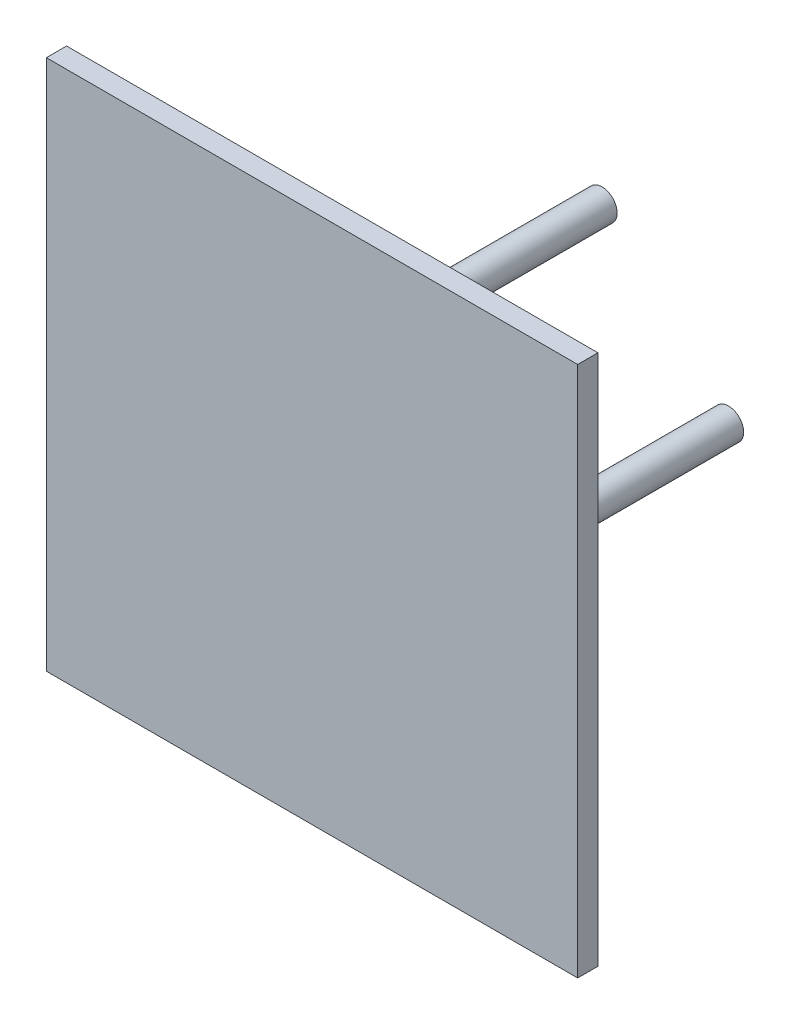
ISO-10303-21;
HEADER;
FILE_DESCRIPTION(('STEP AP214'),'2;1');
FILE_NAME('part.step','',(''),(''),'','','');
FILE_SCHEMA(('AUTOMOTIVE_DESIGN { 1 0 10303 214 1 1 1 1 }'));
ENDSEC;
DATA;
#1=APPLICATION_CONTEXT('core data for automotive mechanical design processes');
#2=APPLICATION_PROTOCOL_DEFINITION('international standard','automotive_design',2000,#1);
#3=PRODUCT_CONTEXT('',#1,'mechanical');
#4=PRODUCT('Part','Part','',(#3));
#5=PRODUCT_RELATED_PRODUCT_CATEGORY('part','',(#4));
#6=PRODUCT_DEFINITION_FORMATION('','',#4);
#7=PRODUCT_DEFINITION_CONTEXT('part definition',#1,'design');
#8=PRODUCT_DEFINITION('design','',#6,#7);
#9=PRODUCT_DEFINITION_SHAPE('','',#8);
#10=(LENGTH_UNIT() NAMED_UNIT(*) SI_UNIT(.MILLI.,.METRE.));
#11=(NAMED_UNIT(*) PLANE_ANGLE_UNIT() SI_UNIT($,.RADIAN.));
#12=(NAMED_UNIT(*) SI_UNIT($,.STERADIAN.) SOLID_ANGLE_UNIT());
#13=UNCERTAINTY_MEASURE_WITH_UNIT(LENGTH_MEASURE(1.E-05),#10,'distance_accuracy_value','');
#14=(GEOMETRIC_REPRESENTATION_CONTEXT(3) GLOBAL_UNCERTAINTY_ASSIGNED_CONTEXT((#13)) GLOBAL_UNIT_ASSIGNED_CONTEXT((#10,
#11,#12)) REPRESENTATION_CONTEXT('',''));
#15=CARTESIAN_POINT('',(0.,0.,0.));
#16=DIRECTION('',(0.,0.,1.));
#17=DIRECTION('',(1.,0.,0.));
#18=AXIS2_PLACEMENT_3D('',#15,#16,#17);
#19=CARTESIAN_POINT('',(0.,0.,0.));
#20=DIRECTION('',(0.,0.,-1.));
#21=DIRECTION('',(-1.,0.,0.));
#22=AXIS2_PLACEMENT_3D('',#19,#20,#21);
#23=PLANE('',#22);
#24=CARTESIAN_POINT('',(77.5,52.5,0.));
#25=DIRECTION('',(0.,0.,-1.));
#26=DIRECTION('',(-1.,0.,0.));
#27=AXIS2_PLACEMENT_3D('',#24,#25,#26);
#28=CIRCLE('',#27,3.00000000000001);
#29=CARTESIAN_POINT('',(74.5,52.5,0.));
#30=VERTEX_POINT('',#29);
#31=EDGE_CURVE('E307',#30,#30,#28,.T.);
#32=ORIENTED_EDGE('',*,*,#31,.F.);
#33=EDGE_LOOP('',(#32));
#34=FACE_BOUND('',#33,.T.);
#35=CARTESIAN_POINT('',(52.5,27.5,0.));
#36=DIRECTION('',(0.,0.,-1.));
#37=DIRECTION('',(-1.,0.,0.));
#38=AXIS2_PLACEMENT_3D('',#35,#36,#37);
#39=CIRCLE('',#38,3.);
#40=CARTESIAN_POINT('',(49.5,27.5,0.));
#41=VERTEX_POINT('',#40);
#42=EDGE_CURVE('E301',#41,#41,#39,.T.);
#43=ORIENTED_EDGE('',*,*,#42,.F.);
#44=EDGE_LOOP('',(#43));
#45=FACE_BOUND('',#44,.T.);
#46=CARTESIAN_POINT('',(27.5,52.5,0.));
#47=DIRECTION('',(0.,0.,-1.));
#48=DIRECTION('',(-1.,0.,0.));
#49=AXIS2_PLACEMENT_3D('',#46,#47,#48);
#50=CIRCLE('',#49,2.99999999999999);
#51=CARTESIAN_POINT('',(24.5,52.5,0.));
#52=VERTEX_POINT('',#51);
#53=EDGE_CURVE('E295',#52,#52,#50,.T.);
#54=ORIENTED_EDGE('',*,*,#53,.F.);
#55=EDGE_LOOP('',(#54));
#56=FACE_BOUND('',#55,.T.);
#57=CARTESIAN_POINT('',(52.5,77.5,0.));
#58=DIRECTION('',(0.,0.,-1.));
#59=DIRECTION('',(-1.,0.,0.));
#60=AXIS2_PLACEMENT_3D('',#57,#58,#59);
#61=CIRCLE('',#60,3.);
#62=CARTESIAN_POINT('',(49.5,77.5,0.));
#63=VERTEX_POINT('',#62);
#64=EDGE_CURVE('E289',#63,#63,#61,.T.);
#65=ORIENTED_EDGE('',*,*,#64,.F.);
#66=EDGE_LOOP('',(#65));
#67=FACE_BOUND('',#66,.T.);
#68=CARTESIAN_POINT('',(52.5,52.5,0.));
#69=DIRECTION('',(0.,0.,-1.));
#70=DIRECTION('',(-1.,0.,0.));
#71=AXIS2_PLACEMENT_3D('',#68,#69,#70);
#72=CIRCLE('',#71,3.);
#73=CARTESIAN_POINT('',(49.5,52.5,0.));
#74=VERTEX_POINT('',#73);
#75=EDGE_CURVE('E162',#74,#74,#72,.T.);
#76=ORIENTED_EDGE('',*,*,#75,.F.);
#77=EDGE_LOOP('',(#76));
#78=FACE_BOUND('',#77,.T.);
#79=DIRECTION('',(0.,-1.,0.));
#80=VECTOR('',#79,1.);
#81=CARTESIAN_POINT('',(0.,0.,0.));
#82=LINE('',#81,#80);
#83=CARTESIAN_POINT('',(0.,105.,0.));
#84=VERTEX_POINT('',#83);
#85=CARTESIAN_POINT('',(0.,0.,0.));
#86=VERTEX_POINT('',#85);
#87=EDGE_CURVE('E173',#84,#86,#82,.T.);
#88=ORIENTED_EDGE('',*,*,#87,.F.);
#89=DIRECTION('',(-1.,0.,0.));
#90=VECTOR('',#89,1.);
#91=CARTESIAN_POINT('',(0.,105.,0.));
#92=LINE('',#91,#90);
#93=CARTESIAN_POINT('',(105.,105.,0.));
#94=VERTEX_POINT('',#93);
#95=EDGE_CURVE('E179',#94,#84,#92,.T.);
#96=ORIENTED_EDGE('',*,*,#95,.F.);
#97=DIRECTION('',(0.,1.,0.));
#98=VECTOR('',#97,1.);
#99=CARTESIAN_POINT('',(105.,0.,0.));
#100=LINE('',#99,#98);
#101=CARTESIAN_POINT('',(105.,0.,0.));
#102=VERTEX_POINT('',#101);
#103=EDGE_CURVE('E190',#102,#94,#100,.T.);
#104=ORIENTED_EDGE('',*,*,#103,.F.);
#105=DIRECTION('',(1.,0.,0.));
#106=VECTOR('',#105,1.);
#107=CARTESIAN_POINT('',(0.,0.,0.));
#108=LINE('',#107,#106);
#109=EDGE_CURVE('E188',#86,#102,#108,.T.);
#110=ORIENTED_EDGE('',*,*,#109,.F.);
#111=EDGE_LOOP('',(#88,#96,#104,#110));
#112=FACE_BOUND('',#111,.T.);
#113=DIRECTION('',(-1.,0.,0.));
#114=VECTOR('',#113,1.);
#115=CARTESIAN_POINT('',(49.4405882918443,53.,0.));
#116=LINE('',#115,#114);
#117=CARTESIAN_POINT('',(49.4405882918443,53.,0.));
#118=VERTEX_POINT('',#117);
#119=CARTESIAN_POINT('',(40.,53.,0.));
#120=VERTEX_POINT('',#119);
#121=EDGE_CURVE('E265',#118,#120,#116,.T.);
#122=ORIENTED_EDGE('',*,*,#121,.F.);
#123=CARTESIAN_POINT('',(52.5,52.5,0.));
#124=DIRECTION('',(0.,0.,1.));
#125=DIRECTION('',(-1.,0.,0.));
#126=AXIS2_PLACEMENT_3D('',#123,#124,#125);
#127=CIRCLE('',#126,3.09999999999999);
#128=CARTESIAN_POINT('',(49.4405882918443,52.,0.));
#129=VERTEX_POINT('',#128);
#130=EDGE_CURVE('E160',#129,#118,#127,.T.);
#131=ORIENTED_EDGE('',*,*,#130,.F.);
#132=DIRECTION('',(1.,0.,0.));
#133=VECTOR('',#132,1.);
#134=CARTESIAN_POINT('',(49.4405882918443,52.,0.));
#135=LINE('',#134,#133);
#136=CARTESIAN_POINT('',(40.,52.,0.));
#137=VERTEX_POINT('',#136);
#138=EDGE_CURVE('E156',#137,#129,#135,.T.);
#139=ORIENTED_EDGE('',*,*,#138,.F.);
#140=DIRECTION('',(0.,1.,0.));
#141=VECTOR('',#140,1.);
#142=CARTESIAN_POINT('',(40.,50.,0.));
#143=LINE('',#142,#141);
#144=CARTESIAN_POINT('',(40.,50.,0.));
#145=VERTEX_POINT('',#144);
#146=EDGE_CURVE('E244',#145,#137,#143,.T.);
#147=ORIENTED_EDGE('',*,*,#146,.F.);
#148=DIRECTION('',(-1.,0.,0.));
#149=VECTOR('',#148,1.);
#150=CARTESIAN_POINT('',(46.5,50.,0.));
#151=LINE('',#150,#149);
#152=CARTESIAN_POINT('',(46.5,50.,0.));
#153=VERTEX_POINT('',#152);
#154=EDGE_CURVE('E271',#153,#145,#151,.T.);
#155=ORIENTED_EDGE('',*,*,#154,.F.);
#156=CARTESIAN_POINT('',(52.5,52.5,0.));
#157=DIRECTION('',(0.,0.,-1.));
#158=DIRECTION('',(-1.,0.,0.));
#159=AXIS2_PLACEMENT_3D('',#156,#157,#158);
#160=CIRCLE('',#159,6.50000000000001);
#161=CARTESIAN_POINT('',(46.5,55.,0.));
#162=VERTEX_POINT('',#161);
#163=EDGE_CURVE('E269',#162,#153,#160,.T.);
#164=ORIENTED_EDGE('',*,*,#163,.F.);
#165=DIRECTION('',(1.,0.,0.));
#166=VECTOR('',#165,1.);
#167=CARTESIAN_POINT('',(46.5,55.,0.));
#168=LINE('',#167,#166);
#169=CARTESIAN_POINT('',(40.,55.,0.));
#170=VERTEX_POINT('',#169);
#171=EDGE_CURVE('E260',#170,#162,#168,.T.);
#172=ORIENTED_EDGE('',*,*,#171,.F.);
#173=DIRECTION('',(0.,1.,0.));
#174=VECTOR('',#173,1.);
#175=CARTESIAN_POINT('',(40.,55.,0.));
#176=LINE('',#175,#174);
#177=EDGE_CURVE('E262',#120,#170,#176,.T.);
#178=ORIENTED_EDGE('',*,*,#177,.F.);
#179=EDGE_LOOP('',(#122,#131,#139,#147,#155,#164,#172,#178));
#180=FACE_BOUND('',#179,.T.);
#181=ADVANCED_FACE('F35',(#34,#45,#56,#67,#78,#112,#180),#23,.T.);
#182=CARTESIAN_POINT('',(0.,0.,4.));
#183=DIRECTION('',(1.,0.,0.));
#184=DIRECTION('',(0.,0.,-1.));
#185=AXIS2_PLACEMENT_3D('',#182,#183,#184);
#186=PLANE('',#185);
#187=ORIENTED_EDGE('',*,*,#87,.T.);
#188=DIRECTION('',(0.,0.,-1.));
#189=VECTOR('',#188,1.);
#190=CARTESIAN_POINT('',(0.,0.,4.));
#191=LINE('',#190,#189);
#192=CARTESIAN_POINT('',(0.,0.,4.));
#193=VERTEX_POINT('',#192);
#194=EDGE_CURVE('E201',#193,#86,#191,.T.);
#195=ORIENTED_EDGE('',*,*,#194,.F.);
#196=DIRECTION('',(0.,-1.,0.));
#197=VECTOR('',#196,1.);
#198=CARTESIAN_POINT('',(0.,0.,4.));
#199=LINE('',#198,#197);
#200=CARTESIAN_POINT('',(0.,105.,4.));
#201=VERTEX_POINT('',#200);
#202=EDGE_CURVE('E175',#201,#193,#199,.T.);
#203=ORIENTED_EDGE('',*,*,#202,.F.);
#204=DIRECTION('',(0.,0.,-1.));
#205=VECTOR('',#204,1.);
#206=CARTESIAN_POINT('',(0.,105.,4.));
#207=LINE('',#206,#205);
#208=EDGE_CURVE('E185',#201,#84,#207,.T.);
#209=ORIENTED_EDGE('',*,*,#208,.T.);
#210=EDGE_LOOP('',(#187,#195,#203,#209));
#211=FACE_BOUND('',#210,.T.);
#212=ADVANCED_FACE('F324',(#211),#186,.F.);
#213=CARTESIAN_POINT('',(0.,0.,4.));
#214=DIRECTION('',(0.,1.,0.));
#215=DIRECTION('',(0.,0.,1.));
#216=AXIS2_PLACEMENT_3D('',#213,#214,#215);
#217=PLANE('',#216);
#218=ORIENTED_EDGE('',*,*,#109,.T.);
#219=DIRECTION('',(0.,0.,-1.));
#220=VECTOR('',#219,1.);
#221=CARTESIAN_POINT('',(105.,0.,4.));
#222=LINE('',#221,#220);
#223=CARTESIAN_POINT('',(105.,0.,4.));
#224=VERTEX_POINT('',#223);
#225=EDGE_CURVE('E198',#224,#102,#222,.T.);
#226=ORIENTED_EDGE('',*,*,#225,.F.);
#227=DIRECTION('',(1.,0.,0.));
#228=VECTOR('',#227,1.);
#229=CARTESIAN_POINT('',(0.,0.,4.));
#230=LINE('',#229,#228);
#231=EDGE_CURVE('E178',#193,#224,#230,.T.);
#232=ORIENTED_EDGE('',*,*,#231,.F.);
#233=ORIENTED_EDGE('',*,*,#194,.T.);
#234=EDGE_LOOP('',(#218,#226,#232,#233));
#235=FACE_BOUND('',#234,.T.);
#236=ADVANCED_FACE('F350',(#235),#217,.F.);
#237=CARTESIAN_POINT('',(105.,0.,4.));
#238=DIRECTION('',(-1.,0.,0.));
#239=DIRECTION('',(0.,0.,1.));
#240=AXIS2_PLACEMENT_3D('',#237,#238,#239);
#241=PLANE('',#240);
#242=ORIENTED_EDGE('',*,*,#103,.T.);
#243=DIRECTION('',(0.,0.,-1.));
#244=VECTOR('',#243,1.);
#245=CARTESIAN_POINT('',(105.,105.,4.));
#246=LINE('',#245,#244);
#247=CARTESIAN_POINT('',(105.,105.,4.));
#248=VERTEX_POINT('',#247);
#249=EDGE_CURVE('E195',#248,#94,#246,.T.);
#250=ORIENTED_EDGE('',*,*,#249,.F.);
#251=DIRECTION('',(0.,1.,0.));
#252=VECTOR('',#251,1.);
#253=CARTESIAN_POINT('',(105.,0.,4.));
#254=LINE('',#253,#252);
#255=EDGE_CURVE('E181',#224,#248,#254,.T.);
#256=ORIENTED_EDGE('',*,*,#255,.F.);
#257=ORIENTED_EDGE('',*,*,#225,.T.);
#258=EDGE_LOOP('',(#242,#250,#256,#257));
#259=FACE_BOUND('',#258,.T.);
#260=ADVANCED_FACE('F347',(#259),#241,.F.);
#261=CARTESIAN_POINT('',(0.,105.,4.));
#262=DIRECTION('',(0.,-1.,0.));
#263=DIRECTION('',(0.,0.,-1.));
#264=AXIS2_PLACEMENT_3D('',#261,#262,#263);
#265=PLANE('',#264);
#266=ORIENTED_EDGE('',*,*,#95,.T.);
#267=ORIENTED_EDGE('',*,*,#208,.F.);
#268=DIRECTION('',(-1.,0.,0.));
#269=VECTOR('',#268,1.);
#270=CARTESIAN_POINT('',(0.,105.,4.));
#271=LINE('',#270,#269);
#272=EDGE_CURVE('E183',#248,#201,#271,.T.);
#273=ORIENTED_EDGE('',*,*,#272,.F.);
#274=ORIENTED_EDGE('',*,*,#249,.T.);
#275=EDGE_LOOP('',(#266,#267,#273,#274));
#276=FACE_BOUND('',#275,.T.);
#277=ADVANCED_FACE('F343',(#276),#265,.F.);
#278=CARTESIAN_POINT('',(0.,0.,4.));
#279=DIRECTION('',(0.,0.,-1.));
#280=DIRECTION('',(-1.,0.,0.));
#281=AXIS2_PLACEMENT_3D('',#278,#279,#280);
#282=PLANE('',#281);
#283=ORIENTED_EDGE('',*,*,#202,.T.);
#284=ORIENTED_EDGE('',*,*,#231,.T.);
#285=ORIENTED_EDGE('',*,*,#255,.T.);
#286=ORIENTED_EDGE('',*,*,#272,.T.);
#287=EDGE_LOOP('',(#283,#284,#285,#286));
#288=FACE_BOUND('',#287,.T.);
#289=ADVANCED_FACE('F352',(#288),#282,.F.);
#290=CARTESIAN_POINT('',(52.5,52.5,2.));
#291=DIRECTION('',(0.,0.,-1.));
#292=DIRECTION('',(-1.,0.,0.));
#293=AXIS2_PLACEMENT_3D('',#290,#291,#292);
#294=CYLINDRICAL_SURFACE('',#293,3.);
#295=CARTESIAN_POINT('',(52.5,52.5,2.));
#296=DIRECTION('',(0.,0.,-1.));
#297=DIRECTION('',(-1.,0.,0.));
#298=AXIS2_PLACEMENT_3D('',#295,#296,#297);
#299=CIRCLE('',#298,3.);
#300=CARTESIAN_POINT('',(49.5,52.5,2.));
#301=VERTEX_POINT('',#300);
#302=EDGE_CURVE('E166',#301,#301,#299,.T.);
#303=ORIENTED_EDGE('',*,*,#302,.F.);
#304=EDGE_LOOP('',(#303));
#305=FACE_BOUND('',#304,.T.);
#306=ORIENTED_EDGE('',*,*,#75,.T.);
#307=EDGE_LOOP('',(#306));
#308=FACE_BOUND('',#307,.T.);
#309=ADVANCED_FACE('F354',(#305,#308),#294,.F.);
#310=CARTESIAN_POINT('',(52.5,52.5,2.));
#311=DIRECTION('',(0.,0.,-1.));
#312=DIRECTION('',(-1.,0.,0.));
#313=AXIS2_PLACEMENT_3D('',#310,#311,#312);
#314=PLANE('',#313);
#315=ORIENTED_EDGE('',*,*,#302,.T.);
#316=EDGE_LOOP('',(#315));
#317=FACE_BOUND('',#316,.T.);
#318=ADVANCED_FACE('F360',(#317),#314,.T.);
#319=CARTESIAN_POINT('',(52.5,52.5,-12.));
#320=DIRECTION('',(0.,0.,1.));
#321=DIRECTION('',(1.,0.,0.));
#322=AXIS2_PLACEMENT_3D('',#319,#320,#321);
#323=CYLINDRICAL_SURFACE('',#322,3.09999999999999);
#324=ORIENTED_EDGE('',*,*,#130,.T.);
#325=DIRECTION('',(0.,0.,1.));
#326=VECTOR('',#325,1.);
#327=CARTESIAN_POINT('',(49.4405882918443,53.,-12.));
#328=LINE('',#327,#326);
#329=CARTESIAN_POINT('',(49.4405882918443,53.,-12.));
#330=VERTEX_POINT('',#329);
#331=EDGE_CURVE('E138',#330,#118,#328,.T.);
#332=ORIENTED_EDGE('',*,*,#331,.F.);
#333=CARTESIAN_POINT('',(52.5,52.5,-12.));
#334=DIRECTION('',(0.,0.,1.));
#335=DIRECTION('',(-1.,0.,0.));
#336=AXIS2_PLACEMENT_3D('',#333,#334,#335);
#337=CIRCLE('',#336,3.09999999999999);
#338=CARTESIAN_POINT('',(49.4405882918443,52.,-12.));
#339=VERTEX_POINT('',#338);
#340=EDGE_CURVE('E145',#339,#330,#337,.T.);
#341=ORIENTED_EDGE('',*,*,#340,.F.);
#342=DIRECTION('',(0.,0.,1.));
#343=VECTOR('',#342,1.);
#344=CARTESIAN_POINT('',(49.4405882918443,52.,-12.));
#345=LINE('',#344,#343);
#346=EDGE_CURVE('E246',#339,#129,#345,.T.);
#347=ORIENTED_EDGE('',*,*,#346,.T.);
#348=EDGE_LOOP('',(#324,#332,#341,#347));
#349=FACE_BOUND('',#348,.T.);
#350=ADVANCED_FACE('F158',(#349),#323,.F.);
#351=CARTESIAN_POINT('',(49.4405882918443,53.,-12.));
#352=DIRECTION('',(0.,1.,0.));
#353=DIRECTION('',(0.,0.,1.));
#354=AXIS2_PLACEMENT_3D('',#351,#352,#353);
#355=PLANE('',#354);
#356=CARTESIAN_POINT('',(43.25,53.,-6.));
#357=DIRECTION('',(0.,1.,0.));
#358=DIRECTION('',(0.,0.,1.));
#359=AXIS2_PLACEMENT_3D('',#356,#357,#358);
#360=CIRCLE('',#359,1.99870195498223);
#361=CARTESIAN_POINT('',(43.25,53.,-4.00129804501777));
#362=VERTEX_POINT('',#361);
#363=EDGE_CURVE('E276',#362,#362,#360,.T.);
#364=ORIENTED_EDGE('',*,*,#363,.T.);
#365=EDGE_LOOP('',(#364));
#366=FACE_BOUND('',#365,.T.);
#367=DIRECTION('',(0.,0.,1.));
#368=VECTOR('',#367,1.);
#369=CARTESIAN_POINT('',(40.,53.,-12.));
#370=LINE('',#369,#368);
#371=CARTESIAN_POINT('',(40.,53.,-11.));
#372=VERTEX_POINT('',#371);
#373=EDGE_CURVE('E163',#372,#120,#370,.T.);
#374=ORIENTED_EDGE('',*,*,#373,.F.);
#375=CARTESIAN_POINT('',(41.,53.,-11.));
#376=DIRECTION('',(0.,1.,0.));
#377=DIRECTION('',(0.,0.,1.));
#378=AXIS2_PLACEMENT_3D('',#375,#376,#377);
#379=CIRCLE('',#378,1.);
#380=CARTESIAN_POINT('',(41.,53.,-12.));
#381=VERTEX_POINT('',#380);
#382=EDGE_CURVE('E11',#372,#381,#379,.F.);
#383=ORIENTED_EDGE('',*,*,#382,.T.);
#384=DIRECTION('',(-1.,0.,0.));
#385=VECTOR('',#384,1.);
#386=CARTESIAN_POINT('',(49.4405882918443,53.,-12.));
#387=LINE('',#386,#385);
#388=EDGE_CURVE('E133',#330,#381,#387,.T.);
#389=ORIENTED_EDGE('',*,*,#388,.F.);
#390=ORIENTED_EDGE('',*,*,#331,.T.);
#391=ORIENTED_EDGE('',*,*,#121,.T.);
#392=EDGE_LOOP('',(#374,#383,#389,#390,#391));
#393=FACE_BOUND('',#392,.T.);
#394=ADVANCED_FACE('F135',(#366,#393),#355,.F.);
#395=CARTESIAN_POINT('',(40.,55.,-12.));
#396=DIRECTION('',(1.,0.,0.));
#397=DIRECTION('',(0.,1.,0.));
#398=AXIS2_PLACEMENT_3D('',#395,#396,#397);
#399=PLANE('',#398);
#400=DIRECTION('',(0.,0.,1.));
#401=VECTOR('',#400,1.);
#402=CARTESIAN_POINT('',(40.,55.,-12.));
#403=LINE('',#402,#401);
#404=CARTESIAN_POINT('',(40.,55.,-11.));
#405=VERTEX_POINT('',#404);
#406=EDGE_CURVE('E168',#405,#170,#403,.T.);
#407=ORIENTED_EDGE('',*,*,#406,.F.);
#408=DIRECTION('',(0.,1.,0.));
#409=VECTOR('',#408,1.);
#410=CARTESIAN_POINT('',(40.,53.,-11.));
#411=LINE('',#410,#409);
#412=EDGE_CURVE('E43',#405,#372,#411,.F.);
#413=ORIENTED_EDGE('',*,*,#412,.T.);
#414=ORIENTED_EDGE('',*,*,#373,.T.);
#415=ORIENTED_EDGE('',*,*,#177,.T.);
#416=EDGE_LOOP('',(#407,#413,#414,#415));
#417=FACE_BOUND('',#416,.T.);
#418=ADVANCED_FACE('F263',(#417),#399,.F.);
#419=CARTESIAN_POINT('',(46.5,55.,-12.));
#420=DIRECTION('',(0.,-1.,0.));
#421=DIRECTION('',(1.,0.,0.));
#422=AXIS2_PLACEMENT_3D('',#419,#420,#421);
#423=PLANE('',#422);
#424=CARTESIAN_POINT('',(43.25,55.,-6.));
#425=DIRECTION('',(0.,1.,0.));
#426=DIRECTION('',(0.,0.,1.));
#427=AXIS2_PLACEMENT_3D('',#424,#425,#426);
#428=CIRCLE('',#427,1.99870195498223);
#429=CARTESIAN_POINT('',(43.25,55.,-4.00129804501777));
#430=VERTEX_POINT('',#429);
#431=EDGE_CURVE('E209',#430,#430,#428,.T.);
#432=ORIENTED_EDGE('',*,*,#431,.F.);
#433=EDGE_LOOP('',(#432));
#434=FACE_BOUND('',#433,.T.);
#435=DIRECTION('',(1.,0.,0.));
#436=VECTOR('',#435,1.);
#437=CARTESIAN_POINT('',(46.5,55.,-12.));
#438=LINE('',#437,#436);
#439=CARTESIAN_POINT('',(41.,55.,-12.));
#440=VERTEX_POINT('',#439);
#441=CARTESIAN_POINT('',(46.5,55.,-12.));
#442=VERTEX_POINT('',#441);
#443=EDGE_CURVE('E144',#440,#442,#438,.T.);
#444=ORIENTED_EDGE('',*,*,#443,.F.);
#445=CARTESIAN_POINT('',(41.,55.,-11.));
#446=DIRECTION('',(0.,-1.,0.));
#447=DIRECTION('',(1.,0.,0.));
#448=AXIS2_PLACEMENT_3D('',#445,#446,#447);
#449=CIRCLE('',#448,1.);
#450=EDGE_CURVE('E57',#440,#405,#449,.F.);
#451=ORIENTED_EDGE('',*,*,#450,.T.);
#452=ORIENTED_EDGE('',*,*,#406,.T.);
#453=ORIENTED_EDGE('',*,*,#171,.T.);
#454=DIRECTION('',(0.,0.,1.));
#455=VECTOR('',#454,1.);
#456=CARTESIAN_POINT('',(46.5,55.,-12.));
#457=LINE('',#456,#455);
#458=EDGE_CURVE('E254',#442,#162,#457,.T.);
#459=ORIENTED_EDGE('',*,*,#458,.F.);
#460=EDGE_LOOP('',(#444,#451,#452,#453,#459));
#461=FACE_BOUND('',#460,.T.);
#462=ADVANCED_FACE('F257',(#434,#461),#423,.F.);
#463=CARTESIAN_POINT('',(52.5,52.5,-12.));
#464=DIRECTION('',(0.,0.,1.));
#465=DIRECTION('',(1.,0.,0.));
#466=AXIS2_PLACEMENT_3D('',#463,#464,#465);
#467=CYLINDRICAL_SURFACE('',#466,6.50000000000001);
#468=ORIENTED_EDGE('',*,*,#163,.T.);
#469=DIRECTION('',(0.,0.,1.));
#470=VECTOR('',#469,1.);
#471=CARTESIAN_POINT('',(46.5,50.,-12.));
#472=LINE('',#471,#470);
#473=CARTESIAN_POINT('',(46.5,50.,-12.));
#474=VERTEX_POINT('',#473);
#475=EDGE_CURVE('E248',#474,#153,#472,.T.);
#476=ORIENTED_EDGE('',*,*,#475,.F.);
#477=CARTESIAN_POINT('',(52.5,52.5,-12.));
#478=DIRECTION('',(0.,0.,-1.));
#479=DIRECTION('',(-1.,0.,0.));
#480=AXIS2_PLACEMENT_3D('',#477,#478,#479);
#481=CIRCLE('',#480,6.50000000000001);
#482=EDGE_CURVE('E232',#442,#474,#481,.T.);
#483=ORIENTED_EDGE('',*,*,#482,.F.);
#484=ORIENTED_EDGE('',*,*,#458,.T.);
#485=EDGE_LOOP('',(#468,#476,#483,#484));
#486=FACE_BOUND('',#485,.T.);
#487=ADVANCED_FACE('F399',(#486),#467,.T.);
#488=CARTESIAN_POINT('',(46.5,50.,-12.));
#489=DIRECTION('',(0.,1.,0.));
#490=DIRECTION('',(0.,0.,1.));
#491=AXIS2_PLACEMENT_3D('',#488,#489,#490);
#492=PLANE('',#491);
#493=CARTESIAN_POINT('',(43.25,50.,-6.));
#494=DIRECTION('',(0.,1.,0.));
#495=DIRECTION('',(0.,0.,1.));
#496=AXIS2_PLACEMENT_3D('',#493,#494,#495);
#497=CIRCLE('',#496,1.99870195498223);
#498=CARTESIAN_POINT('',(43.25,50.,-4.00129804501777));
#499=VERTEX_POINT('',#498);
#500=EDGE_CURVE('E208',#499,#499,#497,.T.);
#501=ORIENTED_EDGE('',*,*,#500,.T.);
#502=EDGE_LOOP('',(#501));
#503=FACE_BOUND('',#502,.T.);
#504=DIRECTION('',(0.,0.,1.));
#505=VECTOR('',#504,1.);
#506=CARTESIAN_POINT('',(40.,50.,-12.));
#507=LINE('',#506,#505);
#508=CARTESIAN_POINT('',(40.,50.,-11.));
#509=VERTEX_POINT('',#508);
#510=EDGE_CURVE('E227',#509,#145,#507,.T.);
#511=ORIENTED_EDGE('',*,*,#510,.F.);
#512=CARTESIAN_POINT('',(41.,50.,-11.));
#513=DIRECTION('',(0.,1.,0.));
#514=DIRECTION('',(0.,0.,1.));
#515=AXIS2_PLACEMENT_3D('',#512,#513,#514);
#516=CIRCLE('',#515,1.);
#517=CARTESIAN_POINT('',(41.,50.,-12.));
#518=VERTEX_POINT('',#517);
#519=EDGE_CURVE('E217',#509,#518,#516,.F.);
#520=ORIENTED_EDGE('',*,*,#519,.T.);
#521=DIRECTION('',(-1.,0.,0.));
#522=VECTOR('',#521,1.);
#523=CARTESIAN_POINT('',(46.5,50.,-12.));
#524=LINE('',#523,#522);
#525=EDGE_CURVE('E225',#474,#518,#524,.T.);
#526=ORIENTED_EDGE('',*,*,#525,.F.);
#527=ORIENTED_EDGE('',*,*,#475,.T.);
#528=ORIENTED_EDGE('',*,*,#154,.T.);
#529=EDGE_LOOP('',(#511,#520,#526,#527,#528));
#530=FACE_BOUND('',#529,.T.);
#531=ADVANCED_FACE('F223',(#503,#530),#492,.F.);
#532=CARTESIAN_POINT('',(40.,50.,-12.));
#533=DIRECTION('',(1.,0.,0.));
#534=DIRECTION('',(0.,0.,-1.));
#535=AXIS2_PLACEMENT_3D('',#532,#533,#534);
#536=PLANE('',#535);
#537=DIRECTION('',(0.,0.,1.));
#538=VECTOR('',#537,1.);
#539=CARTESIAN_POINT('',(40.,52.,-12.));
#540=LINE('',#539,#538);
#541=CARTESIAN_POINT('',(40.,52.,-11.));
#542=VERTEX_POINT('',#541);
#543=EDGE_CURVE('E239',#542,#137,#540,.T.);
#544=ORIENTED_EDGE('',*,*,#543,.F.);
#545=DIRECTION('',(0.,1.,0.));
#546=VECTOR('',#545,1.);
#547=CARTESIAN_POINT('',(40.,50.,-11.));
#548=LINE('',#547,#546);
#549=EDGE_CURVE('E215',#542,#509,#548,.F.);
#550=ORIENTED_EDGE('',*,*,#549,.T.);
#551=ORIENTED_EDGE('',*,*,#510,.T.);
#552=ORIENTED_EDGE('',*,*,#146,.T.);
#553=EDGE_LOOP('',(#544,#550,#551,#552));
#554=FACE_BOUND('',#553,.T.);
#555=ADVANCED_FACE('F242',(#554),#536,.F.);
#556=CARTESIAN_POINT('',(49.4405882918443,52.,-12.));
#557=DIRECTION('',(0.,-1.,0.));
#558=DIRECTION('',(0.,0.,-1.));
#559=AXIS2_PLACEMENT_3D('',#556,#557,#558);
#560=PLANE('',#559);
#561=CARTESIAN_POINT('',(43.25,52.,-6.));
#562=DIRECTION('',(0.,-1.,0.));
#563=DIRECTION('',(0.,0.,-1.));
#564=AXIS2_PLACEMENT_3D('',#561,#562,#563);
#565=CIRCLE('',#564,1.99870195498223);
#566=CARTESIAN_POINT('',(43.25,52.,-7.99870195498223));
#567=VERTEX_POINT('',#566);
#568=EDGE_CURVE('E205',#567,#567,#565,.T.);
#569=ORIENTED_EDGE('',*,*,#568,.T.);
#570=EDGE_LOOP('',(#569));
#571=FACE_BOUND('',#570,.T.);
#572=DIRECTION('',(1.,0.,0.));
#573=VECTOR('',#572,1.);
#574=CARTESIAN_POINT('',(49.4405882918443,52.,-12.));
#575=LINE('',#574,#573);
#576=CARTESIAN_POINT('',(41.,52.,-12.));
#577=VERTEX_POINT('',#576);
#578=EDGE_CURVE('E152',#577,#339,#575,.T.);
#579=ORIENTED_EDGE('',*,*,#578,.F.);
#580=CARTESIAN_POINT('',(41.,52.,-11.));
#581=DIRECTION('',(0.,-1.,0.));
#582=DIRECTION('',(0.,0.,-1.));
#583=AXIS2_PLACEMENT_3D('',#580,#581,#582);
#584=CIRCLE('',#583,1.);
#585=EDGE_CURVE('E213',#577,#542,#584,.F.);
#586=ORIENTED_EDGE('',*,*,#585,.T.);
#587=ORIENTED_EDGE('',*,*,#543,.T.);
#588=ORIENTED_EDGE('',*,*,#138,.T.);
#589=ORIENTED_EDGE('',*,*,#346,.F.);
#590=EDGE_LOOP('',(#579,#586,#587,#588,#589));
#591=FACE_BOUND('',#590,.T.);
#592=ADVANCED_FACE('F238',(#571,#591),#560,.F.);
#593=CARTESIAN_POINT('',(52.5,52.5,-12.));
#594=DIRECTION('',(0.,0.,-1.));
#595=DIRECTION('',(-1.,0.,0.));
#596=AXIS2_PLACEMENT_3D('',#593,#594,#595);
#597=PLANE('',#596);
#598=ORIENTED_EDGE('',*,*,#525,.T.);
#599=DIRECTION('',(0.,1.,0.));
#600=VECTOR('',#599,1.);
#601=CARTESIAN_POINT('',(41.,52.,-12.));
#602=LINE('',#601,#600);
#603=EDGE_CURVE('E211',#518,#577,#602,.T.);
#604=ORIENTED_EDGE('',*,*,#603,.T.);
#605=ORIENTED_EDGE('',*,*,#578,.T.);
#606=ORIENTED_EDGE('',*,*,#340,.T.);
#607=ORIENTED_EDGE('',*,*,#388,.T.);
#608=DIRECTION('',(0.,1.,0.));
#609=VECTOR('',#608,1.);
#610=CARTESIAN_POINT('',(41.,55.,-12.));
#611=LINE('',#610,#609);
#612=EDGE_CURVE('E204',#381,#440,#611,.T.);
#613=ORIENTED_EDGE('',*,*,#612,.T.);
#614=ORIENTED_EDGE('',*,*,#443,.T.);
#615=ORIENTED_EDGE('',*,*,#482,.T.);
#616=EDGE_LOOP('',(#598,#604,#605,#606,#607,#613,#614,#615));
#617=FACE_BOUND('',#616,.T.);
#618=ADVANCED_FACE('F149',(#617),#597,.T.);
#619=CARTESIAN_POINT('',(43.25,43.,-6.));
#620=DIRECTION('',(0.,1.,0.));
#621=DIRECTION('',(0.,0.,1.));
#622=AXIS2_PLACEMENT_3D('',#619,#620,#621);
#623=CYLINDRICAL_SURFACE('',#622,1.99870195498223);
#624=ORIENTED_EDGE('',*,*,#568,.F.);
#625=EDGE_LOOP('',(#624));
#626=FACE_BOUND('',#625,.T.);
#627=ORIENTED_EDGE('',*,*,#500,.F.);
#628=EDGE_LOOP('',(#627));
#629=FACE_BOUND('',#628,.T.);
#630=ADVANCED_FACE('F379',(#626,#629),#623,.F.);
#631=ORIENTED_EDGE('',*,*,#431,.T.);
#632=EDGE_LOOP('',(#631));
#633=FACE_BOUND('',#632,.T.);
#634=ORIENTED_EDGE('',*,*,#363,.F.);
#635=EDGE_LOOP('',(#634));
#636=FACE_BOUND('',#635,.T.);
#637=ADVANCED_FACE('F372',(#633,#636),#623,.F.);
#638=CARTESIAN_POINT('',(41.,52.5,-11.));
#639=DIRECTION('',(0.,-1.,0.));
#640=DIRECTION('',(0.,0.,-1.));
#641=AXIS2_PLACEMENT_3D('',#638,#639,#640);
#642=CYLINDRICAL_SURFACE('',#641,1.);
#643=ORIENTED_EDGE('',*,*,#519,.F.);
#644=ORIENTED_EDGE('',*,*,#549,.F.);
#645=ORIENTED_EDGE('',*,*,#585,.F.);
#646=ORIENTED_EDGE('',*,*,#603,.F.);
#647=EDGE_LOOP('',(#643,#644,#645,#646));
#648=FACE_BOUND('',#647,.T.);
#649=ADVANCED_FACE('F235',(#648),#642,.T.);
#650=CARTESIAN_POINT('',(41.,52.5,-11.));
#651=DIRECTION('',(0.,-1.,0.));
#652=DIRECTION('',(1.,0.,0.));
#653=AXIS2_PLACEMENT_3D('',#650,#651,#652);
#654=CYLINDRICAL_SURFACE('',#653,1.);
#655=ORIENTED_EDGE('',*,*,#382,.F.);
#656=ORIENTED_EDGE('',*,*,#412,.F.);
#657=ORIENTED_EDGE('',*,*,#450,.F.);
#658=ORIENTED_EDGE('',*,*,#612,.F.);
#659=EDGE_LOOP('',(#655,#656,#657,#658));
#660=FACE_BOUND('',#659,.T.);
#661=ADVANCED_FACE('F37',(#660),#654,.T.);
#662=CARTESIAN_POINT('',(52.5,77.5,-53.3));
#663=DIRECTION('',(0.,0.,1.));
#664=DIRECTION('',(1.,0.,0.));
#665=AXIS2_PLACEMENT_3D('',#662,#663,#664);
#666=CYLINDRICAL_SURFACE('',#665,3.);
#667=CARTESIAN_POINT('',(52.5,77.5,-53.3));
#668=DIRECTION('',(0.,0.,-1.));
#669=DIRECTION('',(-1.,0.,0.));
#670=AXIS2_PLACEMENT_3D('',#667,#668,#669);
#671=CIRCLE('',#670,3.);
#672=CARTESIAN_POINT('',(49.5,77.5,-53.3));
#673=VERTEX_POINT('',#672);
#674=EDGE_CURVE('E288',#673,#673,#671,.T.);
#675=ORIENTED_EDGE('',*,*,#674,.F.);
#676=EDGE_LOOP('',(#675));
#677=FACE_BOUND('',#676,.T.);
#678=ORIENTED_EDGE('',*,*,#64,.T.);
#679=EDGE_LOOP('',(#678));
#680=FACE_BOUND('',#679,.T.);
#681=ADVANCED_FACE('F377',(#677,#680),#666,.T.);
#682=CARTESIAN_POINT('',(52.5,77.5,-53.3));
#683=DIRECTION('',(0.,0.,-1.));
#684=DIRECTION('',(-1.,0.,0.));
#685=AXIS2_PLACEMENT_3D('',#682,#683,#684);
#686=PLANE('',#685);
#687=ORIENTED_EDGE('',*,*,#674,.T.);
#688=EDGE_LOOP('',(#687));
#689=FACE_BOUND('',#688,.T.);
#690=ADVANCED_FACE('F485',(#689),#686,.T.);
#691=CARTESIAN_POINT('',(27.5,52.5,-53.3));
#692=DIRECTION('',(0.,0.,1.));
#693=DIRECTION('',(1.,0.,0.));
#694=AXIS2_PLACEMENT_3D('',#691,#692,#693);
#695=CYLINDRICAL_SURFACE('',#694,2.99999999999999);
#696=CARTESIAN_POINT('',(27.5,52.5,-53.3));
#697=DIRECTION('',(0.,0.,-1.));
#698=DIRECTION('',(-1.,0.,0.));
#699=AXIS2_PLACEMENT_3D('',#696,#697,#698);
#700=CIRCLE('',#699,2.99999999999999);
#701=CARTESIAN_POINT('',(24.5,52.5,-53.3));
#702=VERTEX_POINT('',#701);
#703=EDGE_CURVE('E292',#702,#702,#700,.T.);
#704=ORIENTED_EDGE('',*,*,#703,.F.);
#705=EDGE_LOOP('',(#704));
#706=FACE_BOUND('',#705,.T.);
#707=ORIENTED_EDGE('',*,*,#53,.T.);
#708=EDGE_LOOP('',(#707));
#709=FACE_BOUND('',#708,.T.);
#710=ADVANCED_FACE('F493',(#706,#709),#695,.T.);
#711=CARTESIAN_POINT('',(27.5,52.5,-53.3));
#712=DIRECTION('',(0.,0.,-1.));
#713=DIRECTION('',(-1.,0.,0.));
#714=AXIS2_PLACEMENT_3D('',#711,#712,#713);
#715=PLANE('',#714);
#716=ORIENTED_EDGE('',*,*,#703,.T.);
#717=EDGE_LOOP('',(#716));
#718=FACE_BOUND('',#717,.T.);
#719=ADVANCED_FACE('F501',(#718),#715,.T.);
#720=CARTESIAN_POINT('',(52.5,27.5,-53.3));
#721=DIRECTION('',(0.,0.,1.));
#722=DIRECTION('',(1.,0.,0.));
#723=AXIS2_PLACEMENT_3D('',#720,#721,#722);
#724=CYLINDRICAL_SURFACE('',#723,3.);
#725=CARTESIAN_POINT('',(52.5,27.5,-53.3));
#726=DIRECTION('',(0.,0.,-1.));
#727=DIRECTION('',(-1.,0.,0.));
#728=AXIS2_PLACEMENT_3D('',#725,#726,#727);
#729=CIRCLE('',#728,3.);
#730=CARTESIAN_POINT('',(49.5,27.5,-53.3));
#731=VERTEX_POINT('',#730);
#732=EDGE_CURVE('E298',#731,#731,#729,.T.);
#733=ORIENTED_EDGE('',*,*,#732,.F.);
#734=EDGE_LOOP('',(#733));
#735=FACE_BOUND('',#734,.T.);
#736=ORIENTED_EDGE('',*,*,#42,.T.);
#737=EDGE_LOOP('',(#736));
#738=FACE_BOUND('',#737,.T.);
#739=ADVANCED_FACE('F510',(#735,#738),#724,.T.);
#740=CARTESIAN_POINT('',(52.5,27.5,-53.3));
#741=DIRECTION('',(0.,0.,-1.));
#742=DIRECTION('',(-1.,0.,0.));
#743=AXIS2_PLACEMENT_3D('',#740,#741,#742);
#744=PLANE('',#743);
#745=ORIENTED_EDGE('',*,*,#732,.T.);
#746=EDGE_LOOP('',(#745));
#747=FACE_BOUND('',#746,.T.);
#748=ADVANCED_FACE('F318',(#747),#744,.T.);
#749=CARTESIAN_POINT('',(77.5,52.5,-53.3));
#750=DIRECTION('',(0.,0.,1.));
#751=DIRECTION('',(1.,0.,0.));
#752=AXIS2_PLACEMENT_3D('',#749,#750,#751);
#753=CYLINDRICAL_SURFACE('',#752,3.00000000000001);
#754=CARTESIAN_POINT('',(77.5,52.5,-53.3));
#755=DIRECTION('',(0.,0.,-1.));
#756=DIRECTION('',(-1.,0.,0.));
#757=AXIS2_PLACEMENT_3D('',#754,#755,#756);
#758=CIRCLE('',#757,3.00000000000001);
#759=CARTESIAN_POINT('',(74.5,52.5,-53.3));
#760=VERTEX_POINT('',#759);
#761=EDGE_CURVE('E304',#760,#760,#758,.T.);
#762=ORIENTED_EDGE('',*,*,#761,.F.);
#763=EDGE_LOOP('',(#762));
#764=FACE_BOUND('',#763,.T.);
#765=ORIENTED_EDGE('',*,*,#31,.T.);
#766=EDGE_LOOP('',(#765));
#767=FACE_BOUND('',#766,.T.);
#768=ADVANCED_FACE('F315',(#764,#767),#753,.T.);
#769=CARTESIAN_POINT('',(77.5,52.5,-53.3));
#770=DIRECTION('',(0.,0.,-1.));
#771=DIRECTION('',(-1.,0.,0.));
#772=AXIS2_PLACEMENT_3D('',#769,#770,#771);
#773=PLANE('',#772);
#774=ORIENTED_EDGE('',*,*,#761,.T.);
#775=EDGE_LOOP('',(#774));
#776=FACE_BOUND('',#775,.T.);
#777=ADVANCED_FACE('F313',(#776),#773,.T.);
#778=CLOSED_SHELL('',(#181,#212,#236,#260,#277,#289,#309,#318,#350,#394,#418,#462,#487,#531,
#555,#592,#618,#630,#637,#649,#661,#681,#690,#710,#719,#739,#748,#768,#777));
#779=MANIFOLD_SOLID_BREP('B2',#778);
#780=ADVANCED_BREP_SHAPE_REPRESENTATION('',(#18,#779),#14);
#781=SHAPE_DEFINITION_REPRESENTATION(#9,#780);
ENDSEC;
END-ISO-10303-21;
